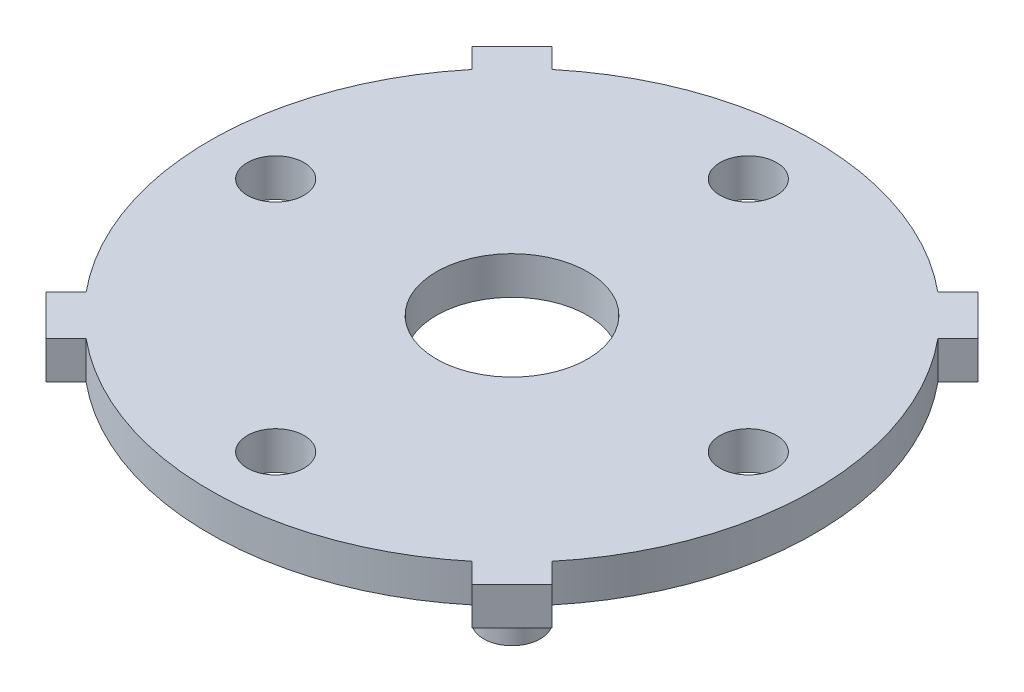
ISO-10303-21;
HEADER;
FILE_DESCRIPTION(('STEP AP214'),'2;1');
FILE_NAME('part.step','',(''),(''),'','','');
FILE_SCHEMA(('AUTOMOTIVE_DESIGN { 1 0 10303 214 1 1 1 1 }'));
ENDSEC;
DATA;
#1=APPLICATION_CONTEXT('core data for automotive mechanical design processes');
#2=APPLICATION_PROTOCOL_DEFINITION('international standard','automotive_design',2000,#1);
#3=PRODUCT_CONTEXT('',#1,'mechanical');
#4=PRODUCT('Part','Part','',(#3));
#5=PRODUCT_RELATED_PRODUCT_CATEGORY('part','',(#4));
#6=PRODUCT_DEFINITION_FORMATION('','',#4);
#7=PRODUCT_DEFINITION_CONTEXT('part definition',#1,'design');
#8=PRODUCT_DEFINITION('design','',#6,#7);
#9=PRODUCT_DEFINITION_SHAPE('','',#8);
#10=(LENGTH_UNIT() NAMED_UNIT(*) SI_UNIT(.MILLI.,.METRE.));
#11=(NAMED_UNIT(*) PLANE_ANGLE_UNIT() SI_UNIT($,.RADIAN.));
#12=(NAMED_UNIT(*) SI_UNIT($,.STERADIAN.) SOLID_ANGLE_UNIT());
#13=UNCERTAINTY_MEASURE_WITH_UNIT(LENGTH_MEASURE(1.E-05),#10,'distance_accuracy_value','');
#14=(GEOMETRIC_REPRESENTATION_CONTEXT(3) GLOBAL_UNCERTAINTY_ASSIGNED_CONTEXT((#13)) GLOBAL_UNIT_ASSIGNED_CONTEXT((#10,
#11,#12)) REPRESENTATION_CONTEXT('',''));
#15=CARTESIAN_POINT('',(0.,0.,0.));
#16=DIRECTION('',(0.,0.,1.));
#17=DIRECTION('',(1.,0.,0.));
#18=AXIS2_PLACEMENT_3D('',#15,#16,#17);
#19=CARTESIAN_POINT('',(0.,2.,0.));
#20=DIRECTION('',(0.,-1.,0.));
#21=DIRECTION('',(0.,0.,-1.));
#22=AXIS2_PLACEMENT_3D('',#19,#20,#21);
#23=CYLINDRICAL_SURFACE('',#22,16.);
#24=CARTESIAN_POINT('',(0.,0.,0.));
#25=DIRECTION('',(0.,1.,0.));
#26=DIRECTION('',(0.,0.,1.));
#27=AXIS2_PLACEMENT_3D('',#24,#25,#26);
#28=CIRCLE('',#27,16.);
#29=CARTESIAN_POINT('',(-10.2032201542892,0.,12.3245404978485));
#30=VERTEX_POINT('',#29);
#31=CARTESIAN_POINT('',(10.2032201542888,0.,12.3245404978488));
#32=VERTEX_POINT('',#31);
#33=EDGE_CURVE('E193',#30,#32,#28,.T.);
#34=ORIENTED_EDGE('',*,*,#33,.T.);
#35=DIRECTION('',(0.,-1.,0.));
#36=VECTOR('',#35,1.);
#37=CARTESIAN_POINT('',(10.2032201542888,2.,12.3245404978488));
#38=LINE('',#37,#36);
#39=CARTESIAN_POINT('',(10.2032201542888,2.,12.3245404978488));
#40=VERTEX_POINT('',#39);
#41=EDGE_CURVE('E43',#40,#32,#38,.T.);
#42=ORIENTED_EDGE('',*,*,#41,.F.);
#43=CARTESIAN_POINT('',(0.,2.,0.));
#44=DIRECTION('',(0.,1.,0.));
#45=DIRECTION('',(0.,0.,1.));
#46=AXIS2_PLACEMENT_3D('',#43,#44,#45);
#47=CIRCLE('',#46,16.);
#48=CARTESIAN_POINT('',(-10.2032201542892,2.,12.3245404978485));
#49=VERTEX_POINT('',#48);
#50=EDGE_CURVE('E112',#49,#40,#47,.T.);
#51=ORIENTED_EDGE('',*,*,#50,.F.);
#52=DIRECTION('',(0.,-1.,0.));
#53=VECTOR('',#52,1.);
#54=CARTESIAN_POINT('',(-10.2032201542892,2.,12.3245404978485));
#55=LINE('',#54,#53);
#56=EDGE_CURVE('E173',#49,#30,#55,.T.);
#57=ORIENTED_EDGE('',*,*,#56,.T.);
#58=EDGE_LOOP('',(#34,#42,#51,#57));
#59=FACE_BOUND('',#58,.T.);
#60=ADVANCED_FACE('F34',(#59),#23,.T.);
#61=CARTESIAN_POINT('',(-1.06066017177994,2.,1.06066017177992));
#62=DIRECTION('',(-0.707106781186552,0.,0.707106781186543));
#63=DIRECTION('',(0.707106781186543,0.,0.707106781186552));
#64=AXIS2_PLACEMENT_3D('',#61,#62,#63);
#65=PLANE('',#64);
#66=DIRECTION('',(-0.707106781186543,0.,-0.707106781186552));
#67=VECTOR('',#66,1.);
#68=CARTESIAN_POINT('',(-1.06066017177994,0.,1.06066017177992));
#69=LINE('',#68,#67);
#70=CARTESIAN_POINT('',(11.2638803260686,0.,13.3852006696286));
#71=VERTEX_POINT('',#70);
#72=EDGE_CURVE('E196',#71,#32,#69,.T.);
#73=ORIENTED_EDGE('',*,*,#72,.F.);
#74=DIRECTION('',(0.,-1.,0.));
#75=VECTOR('',#74,1.);
#76=CARTESIAN_POINT('',(11.2638803260686,2.,13.3852006696286));
#77=LINE('',#76,#75);
#78=CARTESIAN_POINT('',(11.2638803260686,2.,13.3852006696286));
#79=VERTEX_POINT('',#78);
#80=EDGE_CURVE('E254',#79,#71,#77,.T.);
#81=ORIENTED_EDGE('',*,*,#80,.F.);
#82=DIRECTION('',(-0.707106781186543,0.,-0.707106781186552));
#83=VECTOR('',#82,1.);
#84=CARTESIAN_POINT('',(-1.06066017177994,2.,1.06066017177992));
#85=LINE('',#84,#83);
#86=EDGE_CURVE('E259',#79,#40,#85,.T.);
#87=ORIENTED_EDGE('',*,*,#86,.T.);
#88=ORIENTED_EDGE('',*,*,#41,.T.);
#89=EDGE_LOOP('',(#73,#81,#87,#88));
#90=FACE_BOUND('',#89,.T.);
#91=ADVANCED_FACE('F258',(#90),#65,.T.);
#92=CARTESIAN_POINT('',(12.3245404978486,2.,12.3245404978487));
#93=DIRECTION('',(0.707106781186544,0.,0.707106781186551));
#94=DIRECTION('',(0.707106781186551,0.,-0.707106781186544));
#95=AXIS2_PLACEMENT_3D('',#92,#93,#94);
#96=PLANE('',#95);
#97=DIRECTION('',(-0.707106781186551,0.,0.707106781186544));
#98=VECTOR('',#97,1.);
#99=CARTESIAN_POINT('',(12.3245404978486,0.,12.3245404978487));
#100=LINE('',#99,#98);
#101=CARTESIAN_POINT('',(13.3852006696283,0.,11.263880326069));
#102=VERTEX_POINT('',#101);
#103=EDGE_CURVE('E201',#102,#71,#100,.T.);
#104=ORIENTED_EDGE('',*,*,#103,.F.);
#105=DIRECTION('',(0.,-1.,0.));
#106=VECTOR('',#105,1.);
#107=CARTESIAN_POINT('',(13.3852006696283,2.,11.263880326069));
#108=LINE('',#107,#106);
#109=CARTESIAN_POINT('',(13.3852006696283,2.,11.263880326069));
#110=VERTEX_POINT('',#109);
#111=EDGE_CURVE('E252',#110,#102,#108,.T.);
#112=ORIENTED_EDGE('',*,*,#111,.F.);
#113=DIRECTION('',(-0.707106781186551,0.,0.707106781186544));
#114=VECTOR('',#113,1.);
#115=CARTESIAN_POINT('',(12.3245404978486,2.,12.3245404978487));
#116=LINE('',#115,#114);
#117=EDGE_CURVE('E272',#110,#79,#116,.T.);
#118=ORIENTED_EDGE('',*,*,#117,.T.);
#119=ORIENTED_EDGE('',*,*,#80,.T.);
#120=EDGE_LOOP('',(#104,#112,#118,#119));
#121=FACE_BOUND('',#120,.T.);
#122=ADVANCED_FACE('F268',(#121),#96,.T.);
#123=CARTESIAN_POINT('',(1.06066017177972,2.,-1.0606601717797));
#124=DIRECTION('',(-0.707106781186552,0.,0.707106781186543));
#125=DIRECTION('',(0.707106781186543,0.,0.707106781186552));
#126=AXIS2_PLACEMENT_3D('',#123,#124,#125);
#127=PLANE('',#126);
#128=DIRECTION('',(-0.707106781186543,0.,-0.707106781186552));
#129=VECTOR('',#128,1.);
#130=CARTESIAN_POINT('',(1.06066017177972,0.,-1.0606601717797));
#131=LINE('',#130,#129);
#132=CARTESIAN_POINT('',(12.3245404978485,0.,10.2032201542892));
#133=VERTEX_POINT('',#132);
#134=EDGE_CURVE('E204',#102,#133,#131,.T.);
#135=ORIENTED_EDGE('',*,*,#134,.T.);
#136=DIRECTION('',(0.,-1.,0.));
#137=VECTOR('',#136,1.);
#138=CARTESIAN_POINT('',(12.3245404978485,2.,10.2032201542892));
#139=LINE('',#138,#137);
#140=CARTESIAN_POINT('',(12.3245404978485,2.,10.2032201542892));
#141=VERTEX_POINT('',#140);
#142=EDGE_CURVE('E249',#141,#133,#139,.T.);
#143=ORIENTED_EDGE('',*,*,#142,.F.);
#144=DIRECTION('',(-0.707106781186543,0.,-0.707106781186552));
#145=VECTOR('',#144,1.);
#146=CARTESIAN_POINT('',(1.06066017177972,2.,-1.0606601717797));
#147=LINE('',#146,#145);
#148=EDGE_CURVE('E274',#110,#141,#147,.T.);
#149=ORIENTED_EDGE('',*,*,#148,.F.);
#150=ORIENTED_EDGE('',*,*,#111,.T.);
#151=EDGE_LOOP('',(#135,#143,#149,#150));
#152=FACE_BOUND('',#151,.T.);
#153=ADVANCED_FACE('F356',(#152),#127,.F.);
#154=CARTESIAN_POINT('',(12.324540497849,0.,-10.2032201542885));
#155=VERTEX_POINT('',#154);
#156=EDGE_CURVE('E198',#133,#155,#28,.T.);
#157=ORIENTED_EDGE('',*,*,#156,.T.);
#158=DIRECTION('',(0.,-1.,0.));
#159=VECTOR('',#158,1.);
#160=CARTESIAN_POINT('',(12.324540497849,2.,-10.2032201542885));
#161=LINE('',#160,#159);
#162=CARTESIAN_POINT('',(12.324540497849,2.,-10.2032201542885));
#163=VERTEX_POINT('',#162);
#164=EDGE_CURVE('E247',#163,#155,#161,.T.);
#165=ORIENTED_EDGE('',*,*,#164,.F.);
#166=EDGE_CURVE('E278',#141,#163,#47,.T.);
#167=ORIENTED_EDGE('',*,*,#166,.F.);
#168=ORIENTED_EDGE('',*,*,#142,.T.);
#169=EDGE_LOOP('',(#157,#165,#167,#168));
#170=FACE_BOUND('',#169,.T.);
#171=ADVANCED_FACE('F310',(#170),#23,.T.);
#172=CARTESIAN_POINT('',(1.06066017178021,2.,1.06066017178021));
#173=DIRECTION('',(0.707106781186545,0.,0.70710678118655));
#174=DIRECTION('',(0.70710678118655,0.,-0.707106781186545));
#175=AXIS2_PLACEMENT_3D('',#172,#173,#174);
#176=PLANE('',#175);
#177=DIRECTION('',(-0.70710678118655,0.,0.707106781186545));
#178=VECTOR('',#177,1.);
#179=CARTESIAN_POINT('',(1.06066017178021,0.,1.06066017178021));
#180=LINE('',#179,#178);
#181=CARTESIAN_POINT('',(13.3852006696289,0.,-11.2638803260684));
#182=VERTEX_POINT('',#181);
#183=EDGE_CURVE('E206',#182,#155,#180,.T.);
#184=ORIENTED_EDGE('',*,*,#183,.F.);
#185=DIRECTION('',(0.,-1.,0.));
#186=VECTOR('',#185,1.);
#187=CARTESIAN_POINT('',(13.3852006696289,2.,-11.2638803260684));
#188=LINE('',#187,#186);
#189=CARTESIAN_POINT('',(13.3852006696289,2.,-11.2638803260684));
#190=VERTEX_POINT('',#189);
#191=EDGE_CURVE('E245',#190,#182,#188,.T.);
#192=ORIENTED_EDGE('',*,*,#191,.F.);
#193=DIRECTION('',(-0.70710678118655,0.,0.707106781186545));
#194=VECTOR('',#193,1.);
#195=CARTESIAN_POINT('',(1.06066017178021,2.,1.06066017178021));
#196=LINE('',#195,#194);
#197=EDGE_CURVE('E282',#190,#163,#196,.T.);
#198=ORIENTED_EDGE('',*,*,#197,.T.);
#199=ORIENTED_EDGE('',*,*,#164,.T.);
#200=EDGE_LOOP('',(#184,#192,#198,#199));
#201=FACE_BOUND('',#200,.T.);
#202=ADVANCED_FACE('F313',(#201),#176,.T.);
#203=CARTESIAN_POINT('',(12.3245404978487,2.,-12.3245404978486));
#204=DIRECTION('',(0.707106781186551,0.,-0.707106781186544));
#205=DIRECTION('',(-0.707106781186544,0.,-0.707106781186551));
#206=AXIS2_PLACEMENT_3D('',#203,#204,#205);
#207=PLANE('',#206);
#208=DIRECTION('',(0.707106781186544,0.,0.707106781186551));
#209=VECTOR('',#208,1.);
#210=CARTESIAN_POINT('',(12.3245404978487,0.,-12.3245404978486));
#211=LINE('',#210,#209);
#212=CARTESIAN_POINT('',(11.2638803260692,0.,-13.385200669628));
#213=VERTEX_POINT('',#212);
#214=EDGE_CURVE('E209',#213,#182,#211,.T.);
#215=ORIENTED_EDGE('',*,*,#214,.F.);
#216=DIRECTION('',(0.,-1.,0.));
#217=VECTOR('',#216,1.);
#218=CARTESIAN_POINT('',(11.2638803260692,2.,-13.385200669628));
#219=LINE('',#218,#217);
#220=CARTESIAN_POINT('',(11.2638803260692,2.,-13.385200669628));
#221=VERTEX_POINT('',#220);
#222=EDGE_CURVE('E243',#221,#213,#219,.T.);
#223=ORIENTED_EDGE('',*,*,#222,.F.);
#224=DIRECTION('',(0.707106781186544,0.,0.707106781186551));
#225=VECTOR('',#224,1.);
#226=CARTESIAN_POINT('',(12.3245404978487,2.,-12.3245404978486));
#227=LINE('',#226,#225);
#228=EDGE_CURVE('E285',#221,#190,#227,.T.);
#229=ORIENTED_EDGE('',*,*,#228,.T.);
#230=ORIENTED_EDGE('',*,*,#191,.T.);
#231=EDGE_LOOP('',(#215,#223,#229,#230));
#232=FACE_BOUND('',#231,.T.);
#233=ADVANCED_FACE('F316',(#232),#207,.T.);
#234=CARTESIAN_POINT('',(-1.06066017177945,2.,-1.06066017177946));
#235=DIRECTION('',(0.707106781186544,0.,0.707106781186551));
#236=DIRECTION('',(0.707106781186551,0.,-0.707106781186544));
#237=AXIS2_PLACEMENT_3D('',#234,#235,#236);
#238=PLANE('',#237);
#239=DIRECTION('',(-0.707106781186551,0.,0.707106781186544));
#240=VECTOR('',#239,1.);
#241=CARTESIAN_POINT('',(-1.06066017177945,0.,-1.06066017177946));
#242=LINE('',#241,#240);
#243=CARTESIAN_POINT('',(10.2032201542894,0.,-12.3245404978482));
#244=VERTEX_POINT('',#243);
#245=EDGE_CURVE('E212',#213,#244,#242,.T.);
#246=ORIENTED_EDGE('',*,*,#245,.T.);
#247=DIRECTION('',(0.,-1.,0.));
#248=VECTOR('',#247,1.);
#249=CARTESIAN_POINT('',(10.2032201542894,2.,-12.3245404978482));
#250=LINE('',#249,#248);
#251=CARTESIAN_POINT('',(10.2032201542894,2.,-12.3245404978482));
#252=VERTEX_POINT('',#251);
#253=EDGE_CURVE('E240',#252,#244,#250,.T.);
#254=ORIENTED_EDGE('',*,*,#253,.F.);
#255=DIRECTION('',(-0.707106781186551,0.,0.707106781186544));
#256=VECTOR('',#255,1.);
#257=CARTESIAN_POINT('',(-1.06066017177945,2.,-1.06066017177946));
#258=LINE('',#257,#256);
#259=EDGE_CURVE('E288',#221,#252,#258,.T.);
#260=ORIENTED_EDGE('',*,*,#259,.F.);
#261=ORIENTED_EDGE('',*,*,#222,.T.);
#262=EDGE_LOOP('',(#246,#254,#260,#261));
#263=FACE_BOUND('',#262,.T.);
#264=ADVANCED_FACE('F320',(#263),#238,.F.);
#265=CARTESIAN_POINT('',(-10.2032201542888,0.,-12.3245404978488));
#266=VERTEX_POINT('',#265);
#267=EDGE_CURVE('E214',#244,#266,#28,.T.);
#268=ORIENTED_EDGE('',*,*,#267,.T.);
#269=DIRECTION('',(0.,-1.,0.));
#270=VECTOR('',#269,1.);
#271=CARTESIAN_POINT('',(-10.2032201542888,2.,-12.3245404978488));
#272=LINE('',#271,#270);
#273=CARTESIAN_POINT('',(-10.2032201542888,2.,-12.3245404978488));
#274=VERTEX_POINT('',#273);
#275=EDGE_CURVE('E238',#274,#266,#272,.T.);
#276=ORIENTED_EDGE('',*,*,#275,.F.);
#277=EDGE_CURVE('E290',#252,#274,#47,.T.);
#278=ORIENTED_EDGE('',*,*,#277,.F.);
#279=ORIENTED_EDGE('',*,*,#253,.T.);
#280=EDGE_LOOP('',(#268,#276,#278,#279));
#281=FACE_BOUND('',#280,.T.);
#282=ADVANCED_FACE('F325',(#281),#23,.T.);
#283=CARTESIAN_POINT('',(1.06066017177994,2.,-1.06066017177992));
#284=DIRECTION('',(0.707106781186552,0.,-0.707106781186543));
#285=DIRECTION('',(-0.707106781186543,0.,-0.707106781186552));
#286=AXIS2_PLACEMENT_3D('',#283,#284,#285);
#287=PLANE('',#286);
#288=DIRECTION('',(0.707106781186543,0.,0.707106781186552));
#289=VECTOR('',#288,1.);
#290=CARTESIAN_POINT('',(1.06066017177994,0.,-1.06066017177992));
#291=LINE('',#290,#289);
#292=CARTESIAN_POINT('',(-11.2638803260686,0.,-13.3852006696286));
#293=VERTEX_POINT('',#292);
#294=EDGE_CURVE('E215',#293,#266,#291,.T.);
#295=ORIENTED_EDGE('',*,*,#294,.F.);
#296=DIRECTION('',(0.,-1.,0.));
#297=VECTOR('',#296,1.);
#298=CARTESIAN_POINT('',(-11.2638803260686,2.,-13.3852006696286));
#299=LINE('',#298,#297);
#300=CARTESIAN_POINT('',(-11.2638803260686,2.,-13.3852006696286));
#301=VERTEX_POINT('',#300);
#302=EDGE_CURVE('E236',#301,#293,#299,.T.);
#303=ORIENTED_EDGE('',*,*,#302,.F.);
#304=DIRECTION('',(0.707106781186543,0.,0.707106781186552));
#305=VECTOR('',#304,1.);
#306=CARTESIAN_POINT('',(1.06066017177994,2.,-1.06066017177992));
#307=LINE('',#306,#305);
#308=EDGE_CURVE('E291',#301,#274,#307,.T.);
#309=ORIENTED_EDGE('',*,*,#308,.T.);
#310=ORIENTED_EDGE('',*,*,#275,.T.);
#311=EDGE_LOOP('',(#295,#303,#309,#310));
#312=FACE_BOUND('',#311,.T.);
#313=ADVANCED_FACE('F328',(#312),#287,.T.);
#314=CARTESIAN_POINT('',(-12.3245404978486,2.,-12.3245404978487));
#315=DIRECTION('',(-0.707106781186544,0.,-0.707106781186551));
#316=DIRECTION('',(-0.707106781186551,0.,0.707106781186544));
#317=AXIS2_PLACEMENT_3D('',#314,#315,#316);
#318=PLANE('',#317);
#319=DIRECTION('',(0.707106781186551,0.,-0.707106781186544));
#320=VECTOR('',#319,1.);
#321=CARTESIAN_POINT('',(-12.3245404978486,0.,-12.3245404978487));
#322=LINE('',#321,#320);
#323=CARTESIAN_POINT('',(-13.3852006696283,0.,-11.263880326069));
#324=VERTEX_POINT('',#323);
#325=EDGE_CURVE('E218',#324,#293,#322,.T.);
#326=ORIENTED_EDGE('',*,*,#325,.F.);
#327=DIRECTION('',(0.,-1.,0.));
#328=VECTOR('',#327,1.);
#329=CARTESIAN_POINT('',(-13.3852006696283,2.,-11.263880326069));
#330=LINE('',#329,#328);
#331=CARTESIAN_POINT('',(-13.3852006696283,2.,-11.263880326069));
#332=VERTEX_POINT('',#331);
#333=EDGE_CURVE('E234',#332,#324,#330,.T.);
#334=ORIENTED_EDGE('',*,*,#333,.F.);
#335=DIRECTION('',(0.707106781186551,0.,-0.707106781186544));
#336=VECTOR('',#335,1.);
#337=CARTESIAN_POINT('',(-12.3245404978486,2.,-12.3245404978487));
#338=LINE('',#337,#336);
#339=EDGE_CURVE('E294',#332,#301,#338,.T.);
#340=ORIENTED_EDGE('',*,*,#339,.T.);
#341=ORIENTED_EDGE('',*,*,#302,.T.);
#342=EDGE_LOOP('',(#326,#334,#340,#341));
#343=FACE_BOUND('',#342,.T.);
#344=ADVANCED_FACE('F331',(#343),#318,.T.);
#345=CARTESIAN_POINT('',(-1.06066017177972,2.,1.06066017177971));
#346=DIRECTION('',(0.707106781186552,0.,-0.707106781186543));
#347=DIRECTION('',(-0.707106781186543,0.,-0.707106781186552));
#348=AXIS2_PLACEMENT_3D('',#345,#346,#347);
#349=PLANE('',#348);
#350=DIRECTION('',(0.707106781186543,0.,0.707106781186552));
#351=VECTOR('',#350,1.);
#352=CARTESIAN_POINT('',(-1.06066017177972,0.,1.06066017177971));
#353=LINE('',#352,#351);
#354=CARTESIAN_POINT('',(-12.3245404978485,0.,-10.2032201542892));
#355=VERTEX_POINT('',#354);
#356=EDGE_CURVE('E221',#324,#355,#353,.T.);
#357=ORIENTED_EDGE('',*,*,#356,.T.);
#358=DIRECTION('',(0.,-1.,0.));
#359=VECTOR('',#358,1.);
#360=CARTESIAN_POINT('',(-12.3245404978485,2.,-10.2032201542892));
#361=LINE('',#360,#359);
#362=CARTESIAN_POINT('',(-12.3245404978485,2.,-10.2032201542892));
#363=VERTEX_POINT('',#362);
#364=EDGE_CURVE('E231',#363,#355,#361,.T.);
#365=ORIENTED_EDGE('',*,*,#364,.F.);
#366=DIRECTION('',(0.707106781186543,0.,0.707106781186552));
#367=VECTOR('',#366,1.);
#368=CARTESIAN_POINT('',(-1.06066017177972,2.,1.06066017177971));
#369=LINE('',#368,#367);
#370=EDGE_CURVE('E296',#332,#363,#369,.T.);
#371=ORIENTED_EDGE('',*,*,#370,.F.);
#372=ORIENTED_EDGE('',*,*,#333,.T.);
#373=EDGE_LOOP('',(#357,#365,#371,#372));
#374=FACE_BOUND('',#373,.T.);
#375=ADVANCED_FACE('F334',(#374),#349,.F.);
#376=CARTESIAN_POINT('',(-12.3245404978488,0.,10.2032201542888));
#377=VERTEX_POINT('',#376);
#378=EDGE_CURVE('E197',#355,#377,#28,.T.);
#379=ORIENTED_EDGE('',*,*,#378,.T.);
#380=DIRECTION('',(0.,-1.,0.));
#381=VECTOR('',#380,1.);
#382=CARTESIAN_POINT('',(-12.3245404978488,2.,10.2032201542888));
#383=LINE('',#382,#381);
#384=CARTESIAN_POINT('',(-12.3245404978488,2.,10.2032201542888));
#385=VERTEX_POINT('',#384);
#386=EDGE_CURVE('E163',#385,#377,#383,.T.);
#387=ORIENTED_EDGE('',*,*,#386,.F.);
#388=EDGE_CURVE('E168',#363,#385,#47,.T.);
#389=ORIENTED_EDGE('',*,*,#388,.F.);
#390=ORIENTED_EDGE('',*,*,#364,.T.);
#391=EDGE_LOOP('',(#379,#387,#389,#390));
#392=FACE_BOUND('',#391,.T.);
#393=ADVANCED_FACE('F338',(#392),#23,.T.);
#394=CARTESIAN_POINT('',(-1.06066017177992,2.,-1.06066017177994));
#395=DIRECTION('',(-0.707106781186543,0.,-0.707106781186552));
#396=DIRECTION('',(-0.707106781186552,0.,0.707106781186543));
#397=AXIS2_PLACEMENT_3D('',#394,#395,#396);
#398=PLANE('',#397);
#399=DIRECTION('',(0.707106781186552,0.,-0.707106781186543));
#400=VECTOR('',#399,1.);
#401=CARTESIAN_POINT('',(-1.06066017177992,0.,-1.06066017177994));
#402=LINE('',#401,#400);
#403=CARTESIAN_POINT('',(-13.3852006696286,0.,11.2638803260686));
#404=VERTEX_POINT('',#403);
#405=EDGE_CURVE('E158',#404,#377,#402,.T.);
#406=ORIENTED_EDGE('',*,*,#405,.F.);
#407=DIRECTION('',(0.,-1.,0.));
#408=VECTOR('',#407,1.);
#409=CARTESIAN_POINT('',(-13.3852006696286,2.,11.2638803260686));
#410=LINE('',#409,#408);
#411=CARTESIAN_POINT('',(-13.3852006696286,2.,11.2638803260686));
#412=VERTEX_POINT('',#411);
#413=EDGE_CURVE('E153',#412,#404,#410,.T.);
#414=ORIENTED_EDGE('',*,*,#413,.F.);
#415=DIRECTION('',(0.707106781186552,0.,-0.707106781186543));
#416=VECTOR('',#415,1.);
#417=CARTESIAN_POINT('',(-1.06066017177992,2.,-1.06066017177994));
#418=LINE('',#417,#416);
#419=EDGE_CURVE('E156',#412,#385,#418,.T.);
#420=ORIENTED_EDGE('',*,*,#419,.T.);
#421=ORIENTED_EDGE('',*,*,#386,.T.);
#422=EDGE_LOOP('',(#406,#414,#420,#421));
#423=FACE_BOUND('',#422,.T.);
#424=ADVANCED_FACE('F155',(#423),#398,.T.);
#425=CARTESIAN_POINT('',(-12.3245404978487,2.,12.3245404978486));
#426=DIRECTION('',(-0.707106781186551,0.,0.707106781186544));
#427=DIRECTION('',(0.707106781186544,0.,0.707106781186551));
#428=AXIS2_PLACEMENT_3D('',#425,#426,#427);
#429=PLANE('',#428);
#430=DIRECTION('',(-0.707106781186544,0.,-0.707106781186551));
#431=VECTOR('',#430,1.);
#432=CARTESIAN_POINT('',(-12.3245404978487,0.,12.3245404978486));
#433=LINE('',#432,#431);
#434=CARTESIAN_POINT('',(-11.263880326069,0.,13.3852006696283));
#435=VERTEX_POINT('',#434);
#436=EDGE_CURVE('E224',#435,#404,#433,.T.);
#437=ORIENTED_EDGE('',*,*,#436,.F.);
#438=DIRECTION('',(0.,-1.,0.));
#439=VECTOR('',#438,1.);
#440=CARTESIAN_POINT('',(-11.263880326069,2.,13.3852006696283));
#441=LINE('',#440,#439);
#442=CARTESIAN_POINT('',(-11.263880326069,2.,13.3852006696283));
#443=VERTEX_POINT('',#442);
#444=EDGE_CURVE('E103',#443,#435,#441,.T.);
#445=ORIENTED_EDGE('',*,*,#444,.F.);
#446=DIRECTION('',(-0.707106781186544,0.,-0.707106781186551));
#447=VECTOR('',#446,1.);
#448=CARTESIAN_POINT('',(-12.3245404978487,2.,12.3245404978486));
#449=LINE('',#448,#447);
#450=EDGE_CURVE('E166',#443,#412,#449,.T.);
#451=ORIENTED_EDGE('',*,*,#450,.T.);
#452=ORIENTED_EDGE('',*,*,#413,.T.);
#453=EDGE_LOOP('',(#437,#445,#451,#452));
#454=FACE_BOUND('',#453,.T.);
#455=ADVANCED_FACE('F171',(#454),#429,.T.);
#456=CARTESIAN_POINT('',(0.,2.,0.));
#457=DIRECTION('',(0.,-1.,0.));
#458=DIRECTION('',(0.,0.,-1.));
#459=AXIS2_PLACEMENT_3D('',#456,#457,#458);
#460=CYLINDRICAL_SURFACE('',#459,4.);
#461=CARTESIAN_POINT('',(0.,2.,0.));
#462=DIRECTION('',(0.,1.,0.));
#463=DIRECTION('',(0.,0.,1.));
#464=AXIS2_PLACEMENT_3D('',#461,#462,#463);
#465=CIRCLE('',#464,4.);
#466=CARTESIAN_POINT('',(0.,2.,4.));
#467=VERTEX_POINT('',#466);
#468=EDGE_CURVE('E276',#467,#467,#465,.T.);
#469=ORIENTED_EDGE('',*,*,#468,.T.);
#470=EDGE_LOOP('',(#469));
#471=FACE_BOUND('',#470,.T.);
#472=CARTESIAN_POINT('',(0.,0.,0.));
#473=DIRECTION('',(0.,1.,0.));
#474=DIRECTION('',(0.,0.,1.));
#475=AXIS2_PLACEMENT_3D('',#472,#473,#474);
#476=CIRCLE('',#475,4.);
#477=CARTESIAN_POINT('',(0.,0.,4.));
#478=VERTEX_POINT('',#477);
#479=EDGE_CURVE('E190',#478,#478,#476,.T.);
#480=ORIENTED_EDGE('',*,*,#479,.F.);
#481=EDGE_LOOP('',(#480));
#482=FACE_BOUND('',#481,.T.);
#483=ADVANCED_FACE('F372',(#471,#482),#460,.F.);
#484=CARTESIAN_POINT('',(0.,2.,-12.5));
#485=DIRECTION('',(0.,-1.,0.));
#486=DIRECTION('',(0.,0.,-1.));
#487=AXIS2_PLACEMENT_3D('',#484,#485,#486);
#488=CYLINDRICAL_SURFACE('',#487,1.5);
#489=CARTESIAN_POINT('',(0.,2.,-12.5));
#490=DIRECTION('',(0.,1.,0.));
#491=DIRECTION('',(0.,0.,1.));
#492=AXIS2_PLACEMENT_3D('',#489,#490,#491);
#493=CIRCLE('',#492,1.5);
#494=CARTESIAN_POINT('',(0.,2.,-11.));
#495=VERTEX_POINT('',#494);
#496=EDGE_CURVE('E500',#495,#495,#493,.T.);
#497=ORIENTED_EDGE('',*,*,#496,.T.);
#498=EDGE_LOOP('',(#497));
#499=FACE_BOUND('',#498,.T.);
#500=CARTESIAN_POINT('',(0.,0.,-12.5));
#501=DIRECTION('',(0.,1.,0.));
#502=DIRECTION('',(0.,0.,1.));
#503=AXIS2_PLACEMENT_3D('',#500,#501,#502);
#504=CIRCLE('',#503,1.5);
#505=CARTESIAN_POINT('',(0.,0.,-11.));
#506=VERTEX_POINT('',#505);
#507=EDGE_CURVE('E187',#506,#506,#504,.T.);
#508=ORIENTED_EDGE('',*,*,#507,.F.);
#509=EDGE_LOOP('',(#508));
#510=FACE_BOUND('',#509,.T.);
#511=ADVANCED_FACE('F375',(#499,#510),#488,.F.);
#512=CARTESIAN_POINT('',(12.5,2.,0.));
#513=DIRECTION('',(0.,-1.,0.));
#514=DIRECTION('',(0.,0.,-1.));
#515=AXIS2_PLACEMENT_3D('',#512,#513,#514);
#516=CYLINDRICAL_SURFACE('',#515,1.50000000000004);
#517=CARTESIAN_POINT('',(12.5,2.,0.));
#518=DIRECTION('',(0.,1.,0.));
#519=DIRECTION('',(0.,0.,1.));
#520=AXIS2_PLACEMENT_3D('',#517,#518,#519);
#521=CIRCLE('',#520,1.50000000000004);
#522=CARTESIAN_POINT('',(12.5,2.,1.50000000000004));
#523=VERTEX_POINT('',#522);
#524=EDGE_CURVE('E497',#523,#523,#521,.T.);
#525=ORIENTED_EDGE('',*,*,#524,.T.);
#526=EDGE_LOOP('',(#525));
#527=FACE_BOUND('',#526,.T.);
#528=CARTESIAN_POINT('',(12.5,0.,0.));
#529=DIRECTION('',(0.,1.,0.));
#530=DIRECTION('',(0.,0.,1.));
#531=AXIS2_PLACEMENT_3D('',#528,#529,#530);
#532=CIRCLE('',#531,1.50000000000004);
#533=CARTESIAN_POINT('',(12.5,0.,1.50000000000004));
#534=VERTEX_POINT('',#533);
#535=EDGE_CURVE('E184',#534,#534,#532,.T.);
#536=ORIENTED_EDGE('',*,*,#535,.F.);
#537=EDGE_LOOP('',(#536));
#538=FACE_BOUND('',#537,.T.);
#539=ADVANCED_FACE('F379',(#527,#538),#516,.F.);
#540=CARTESIAN_POINT('',(0.,2.,12.5));
#541=DIRECTION('',(0.,-1.,0.));
#542=DIRECTION('',(0.,0.,-1.));
#543=AXIS2_PLACEMENT_3D('',#540,#541,#542);
#544=CYLINDRICAL_SURFACE('',#543,1.50000000000008);
#545=CARTESIAN_POINT('',(0.,2.,12.5));
#546=DIRECTION('',(0.,1.,0.));
#547=DIRECTION('',(0.,0.,1.));
#548=AXIS2_PLACEMENT_3D('',#545,#546,#547);
#549=CIRCLE('',#548,1.50000000000008);
#550=CARTESIAN_POINT('',(0.,2.,14.0000000000001));
#551=VERTEX_POINT('',#550);
#552=EDGE_CURVE('E394',#551,#551,#549,.T.);
#553=ORIENTED_EDGE('',*,*,#552,.T.);
#554=EDGE_LOOP('',(#553));
#555=FACE_BOUND('',#554,.T.);
#556=CARTESIAN_POINT('',(0.,0.,12.5));
#557=DIRECTION('',(0.,1.,0.));
#558=DIRECTION('',(0.,0.,1.));
#559=AXIS2_PLACEMENT_3D('',#556,#557,#558);
#560=CIRCLE('',#559,1.50000000000008);
#561=CARTESIAN_POINT('',(0.,0.,14.0000000000001));
#562=VERTEX_POINT('',#561);
#563=EDGE_CURVE('E180',#562,#562,#560,.T.);
#564=ORIENTED_EDGE('',*,*,#563,.F.);
#565=EDGE_LOOP('',(#564));
#566=FACE_BOUND('',#565,.T.);
#567=ADVANCED_FACE('F382',(#555,#566),#544,.F.);
#568=CARTESIAN_POINT('',(-12.5,2.,0.));
#569=DIRECTION('',(0.,-1.,0.));
#570=DIRECTION('',(0.,0.,-1.));
#571=AXIS2_PLACEMENT_3D('',#568,#569,#570);
#572=CYLINDRICAL_SURFACE('',#571,1.50000000000013);
#573=CARTESIAN_POINT('',(-12.5,2.,0.));
#574=DIRECTION('',(0.,1.,0.));
#575=DIRECTION('',(0.,0.,1.));
#576=AXIS2_PLACEMENT_3D('',#573,#574,#575);
#577=CIRCLE('',#576,1.50000000000013);
#578=CARTESIAN_POINT('',(-12.5,2.,1.50000000000013));
#579=VERTEX_POINT('',#578);
#580=EDGE_CURVE('E227',#579,#579,#577,.T.);
#581=ORIENTED_EDGE('',*,*,#580,.T.);
#582=EDGE_LOOP('',(#581));
#583=FACE_BOUND('',#582,.T.);
#584=CARTESIAN_POINT('',(-12.5,0.,0.));
#585=DIRECTION('',(0.,1.,0.));
#586=DIRECTION('',(0.,0.,1.));
#587=AXIS2_PLACEMENT_3D('',#584,#585,#586);
#588=CIRCLE('',#587,1.50000000000013);
#589=CARTESIAN_POINT('',(-12.5,0.,1.50000000000013));
#590=VERTEX_POINT('',#589);
#591=EDGE_CURVE('E177',#590,#590,#588,.T.);
#592=ORIENTED_EDGE('',*,*,#591,.F.);
#593=EDGE_LOOP('',(#592));
#594=FACE_BOUND('',#593,.T.);
#595=ADVANCED_FACE('F36',(#583,#594),#572,.F.);
#596=CARTESIAN_POINT('',(1.06066017177971,2.,1.06066017177972));
#597=DIRECTION('',(-0.707106781186543,0.,-0.707106781186552));
#598=DIRECTION('',(-0.707106781186552,0.,0.707106781186543));
#599=AXIS2_PLACEMENT_3D('',#596,#597,#598);
#600=PLANE('',#599);
#601=DIRECTION('',(0.707106781186552,0.,-0.707106781186543));
#602=VECTOR('',#601,1.);
#603=CARTESIAN_POINT('',(1.06066017177971,0.,1.06066017177972));
#604=LINE('',#603,#602);
#605=EDGE_CURVE('E106',#435,#30,#604,.T.);
#606=ORIENTED_EDGE('',*,*,#605,.T.);
#607=ORIENTED_EDGE('',*,*,#56,.F.);
#608=DIRECTION('',(0.707106781186552,0.,-0.707106781186543));
#609=VECTOR('',#608,1.);
#610=CARTESIAN_POINT('',(1.06066017177971,2.,1.06066017177972));
#611=LINE('',#610,#609);
#612=EDGE_CURVE('E51',#443,#49,#611,.T.);
#613=ORIENTED_EDGE('',*,*,#612,.F.);
#614=ORIENTED_EDGE('',*,*,#444,.T.);
#615=EDGE_LOOP('',(#606,#607,#613,#614));
#616=FACE_BOUND('',#615,.T.);
#617=ADVANCED_FACE('F389',(#616),#600,.F.);
#618=CARTESIAN_POINT('',(0.,2.,0.));
#619=DIRECTION('',(0.,1.,0.));
#620=DIRECTION('',(0.,0.,1.));
#621=AXIS2_PLACEMENT_3D('',#618,#619,#620);
#622=PLANE('',#621);
#623=ORIENTED_EDGE('',*,*,#580,.F.);
#624=EDGE_LOOP('',(#623));
#625=FACE_BOUND('',#624,.T.);
#626=ORIENTED_EDGE('',*,*,#552,.F.);
#627=EDGE_LOOP('',(#626));
#628=FACE_BOUND('',#627,.T.);
#629=ORIENTED_EDGE('',*,*,#524,.F.);
#630=EDGE_LOOP('',(#629));
#631=FACE_BOUND('',#630,.T.);
#632=ORIENTED_EDGE('',*,*,#496,.F.);
#633=EDGE_LOOP('',(#632));
#634=FACE_BOUND('',#633,.T.);
#635=ORIENTED_EDGE('',*,*,#468,.F.);
#636=EDGE_LOOP('',(#635));
#637=FACE_BOUND('',#636,.T.);
#638=ORIENTED_EDGE('',*,*,#50,.T.);
#639=ORIENTED_EDGE('',*,*,#86,.F.);
#640=ORIENTED_EDGE('',*,*,#117,.F.);
#641=ORIENTED_EDGE('',*,*,#148,.T.);
#642=ORIENTED_EDGE('',*,*,#166,.T.);
#643=ORIENTED_EDGE('',*,*,#197,.F.);
#644=ORIENTED_EDGE('',*,*,#228,.F.);
#645=ORIENTED_EDGE('',*,*,#259,.T.);
#646=ORIENTED_EDGE('',*,*,#277,.T.);
#647=ORIENTED_EDGE('',*,*,#308,.F.);
#648=ORIENTED_EDGE('',*,*,#339,.F.);
#649=ORIENTED_EDGE('',*,*,#370,.T.);
#650=ORIENTED_EDGE('',*,*,#388,.T.);
#651=ORIENTED_EDGE('',*,*,#419,.F.);
#652=ORIENTED_EDGE('',*,*,#450,.F.);
#653=ORIENTED_EDGE('',*,*,#612,.T.);
#654=EDGE_LOOP('',(#638,#639,#640,#641,#642,#643,#644,#645,#646,#647,#648,#649,#650,#651,#652,#653));
#655=FACE_BOUND('',#654,.T.);
#656=ADVANCED_FACE('F165',(#625,#628,#631,#634,#637,#655),#622,.T.);
#657=CARTESIAN_POINT('',(0.,0.,0.));
#658=DIRECTION('',(0.,1.,0.));
#659=DIRECTION('',(0.,0.,1.));
#660=AXIS2_PLACEMENT_3D('',#657,#658,#659);
#661=PLANE('',#660);
#662=CARTESIAN_POINT('',(7.07106781186551,0.,7.07106781186544));
#663=DIRECTION('',(0.,1.,0.));
#664=DIRECTION('',(0.,0.,1.));
#665=AXIS2_PLACEMENT_3D('',#662,#663,#664);
#666=CIRCLE('',#665,1.5);
#667=CARTESIAN_POINT('',(7.07106781186551,0.,8.57106781186544));
#668=VERTEX_POINT('',#667);
#669=EDGE_CURVE('E11',#668,#668,#666,.F.);
#670=ORIENTED_EDGE('',*,*,#669,.F.);
#671=EDGE_LOOP('',(#670));
#672=FACE_BOUND('',#671,.T.);
#673=ORIENTED_EDGE('',*,*,#591,.T.);
#674=EDGE_LOOP('',(#673));
#675=FACE_BOUND('',#674,.T.);
#676=ORIENTED_EDGE('',*,*,#563,.T.);
#677=EDGE_LOOP('',(#676));
#678=FACE_BOUND('',#677,.T.);
#679=ORIENTED_EDGE('',*,*,#535,.T.);
#680=EDGE_LOOP('',(#679));
#681=FACE_BOUND('',#680,.T.);
#682=ORIENTED_EDGE('',*,*,#507,.T.);
#683=EDGE_LOOP('',(#682));
#684=FACE_BOUND('',#683,.T.);
#685=ORIENTED_EDGE('',*,*,#479,.T.);
#686=EDGE_LOOP('',(#685));
#687=FACE_BOUND('',#686,.T.);
#688=ORIENTED_EDGE('',*,*,#33,.F.);
#689=ORIENTED_EDGE('',*,*,#605,.F.);
#690=ORIENTED_EDGE('',*,*,#436,.T.);
#691=ORIENTED_EDGE('',*,*,#405,.T.);
#692=ORIENTED_EDGE('',*,*,#378,.F.);
#693=ORIENTED_EDGE('',*,*,#356,.F.);
#694=ORIENTED_EDGE('',*,*,#325,.T.);
#695=ORIENTED_EDGE('',*,*,#294,.T.);
#696=ORIENTED_EDGE('',*,*,#267,.F.);
#697=ORIENTED_EDGE('',*,*,#245,.F.);
#698=ORIENTED_EDGE('',*,*,#214,.T.);
#699=ORIENTED_EDGE('',*,*,#183,.T.);
#700=ORIENTED_EDGE('',*,*,#156,.F.);
#701=ORIENTED_EDGE('',*,*,#134,.F.);
#702=ORIENTED_EDGE('',*,*,#103,.T.);
#703=ORIENTED_EDGE('',*,*,#72,.T.);
#704=EDGE_LOOP('',(#688,#689,#690,#691,#692,#693,#694,#695,#696,#697,#698,#699,#700,#701,#702,#703));
#705=FACE_BOUND('',#704,.T.);
#706=ADVANCED_FACE('F263',(#672,#675,#678,#681,#684,#687,#705),#661,.F.);
#707=CARTESIAN_POINT('',(7.07106781186551,-5.,7.07106781186544));
#708=DIRECTION('',(0.,1.,0.));
#709=DIRECTION('',(0.,0.,1.));
#710=AXIS2_PLACEMENT_3D('',#707,#708,#709);
#711=CYLINDRICAL_SURFACE('',#710,1.5);
#712=CARTESIAN_POINT('',(7.07106781186551,-5.,7.07106781186544));
#713=DIRECTION('',(0.,-1.,0.));
#714=DIRECTION('',(0.,0.,-1.));
#715=AXIS2_PLACEMENT_3D('',#712,#713,#714);
#716=CIRCLE('',#715,1.5);
#717=CARTESIAN_POINT('',(7.07106781186551,-5.,5.57106781186544));
#718=VERTEX_POINT('',#717);
#719=EDGE_CURVE('E181',#718,#718,#716,.T.);
#720=ORIENTED_EDGE('',*,*,#719,.F.);
#721=EDGE_LOOP('',(#720));
#722=FACE_BOUND('',#721,.T.);
#723=ORIENTED_EDGE('',*,*,#669,.T.);
#724=EDGE_LOOP('',(#723));
#725=FACE_BOUND('',#724,.T.);
#726=ADVANCED_FACE('F399',(#722,#725),#711,.T.);
#727=CARTESIAN_POINT('',(7.07106781186551,-5.,7.07106781186544));
#728=DIRECTION('',(0.,-1.,0.));
#729=DIRECTION('',(0.,0.,-1.));
#730=AXIS2_PLACEMENT_3D('',#727,#728,#729);
#731=PLANE('',#730);
#732=ORIENTED_EDGE('',*,*,#719,.T.);
#733=EDGE_LOOP('',(#732));
#734=FACE_BOUND('',#733,.T.);
#735=ADVANCED_FACE('F414',(#734),#731,.T.);
#736=CLOSED_SHELL('',(#60,#91,#122,#153,#171,#202,#233,#264,#282,#313,#344,#375,#393,#424,#455,
#483,#511,#539,#567,#595,#617,#656,#706,#726,#735));
#737=MANIFOLD_SOLID_BREP('B2',#736);
#738=ADVANCED_BREP_SHAPE_REPRESENTATION('',(#18,#737),#14);
#739=SHAPE_DEFINITION_REPRESENTATION(#9,#738);
ENDSEC;
END-ISO-10303-21;
